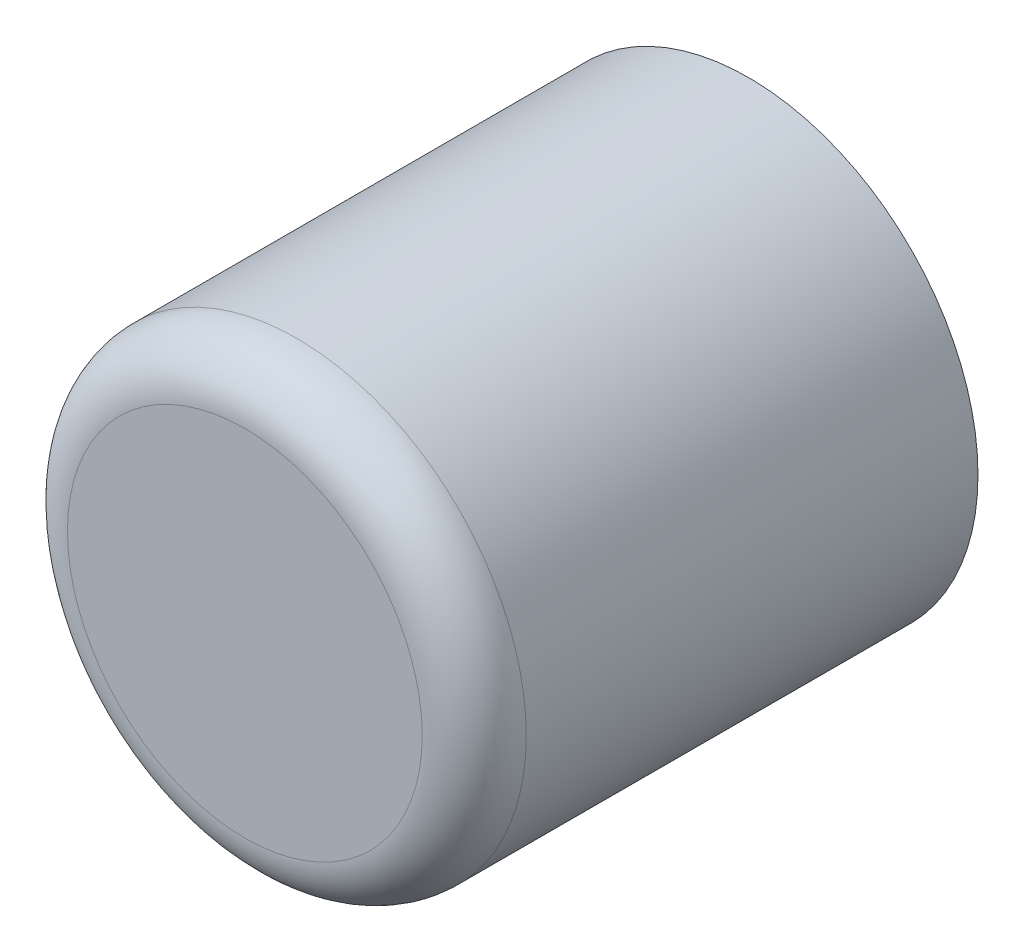
ISO-10303-21;
HEADER;
FILE_DESCRIPTION(('STEP AP214'),'2;1');
FILE_NAME('part.step','',(''),(''),'','','');
FILE_SCHEMA(('AUTOMOTIVE_DESIGN { 1 0 10303 214 1 1 1 1 }'));
ENDSEC;
DATA;
#1=APPLICATION_CONTEXT('core data for automotive mechanical design processes');
#2=APPLICATION_PROTOCOL_DEFINITION('international standard','automotive_design',2000,#1);
#3=PRODUCT_CONTEXT('',#1,'mechanical');
#4=PRODUCT('Part','Part','',(#3));
#5=PRODUCT_RELATED_PRODUCT_CATEGORY('part','',(#4));
#6=PRODUCT_DEFINITION_FORMATION('','',#4);
#7=PRODUCT_DEFINITION_CONTEXT('part definition',#1,'design');
#8=PRODUCT_DEFINITION('design','',#6,#7);
#9=PRODUCT_DEFINITION_SHAPE('','',#8);
#10=(LENGTH_UNIT() NAMED_UNIT(*) SI_UNIT(.MILLI.,.METRE.));
#11=(NAMED_UNIT(*) PLANE_ANGLE_UNIT() SI_UNIT($,.RADIAN.));
#12=(NAMED_UNIT(*) SI_UNIT($,.STERADIAN.) SOLID_ANGLE_UNIT());
#13=UNCERTAINTY_MEASURE_WITH_UNIT(LENGTH_MEASURE(1.E-05),#10,'distance_accuracy_value','');
#14=(GEOMETRIC_REPRESENTATION_CONTEXT(3) GLOBAL_UNCERTAINTY_ASSIGNED_CONTEXT((#13)) GLOBAL_UNIT_ASSIGNED_CONTEXT((#10,
#11,#12)) REPRESENTATION_CONTEXT('',''));
#15=CARTESIAN_POINT('',(0.,0.,0.));
#16=DIRECTION('',(0.,0.,1.));
#17=DIRECTION('',(1.,0.,0.));
#18=AXIS2_PLACEMENT_3D('',#15,#16,#17);
#19=CARTESIAN_POINT('',(-126.423352159799,-34.2539777719787,5.6300000000009));
#20=DIRECTION('',(0.,0.,1.));
#21=DIRECTION('',(1.,0.,0.));
#22=AXIS2_PLACEMENT_3D('',#19,#20,#21);
#23=PLANE('',#22);
#24=CARTESIAN_POINT('',(-127.923352159799,-34.2539777719787,5.63000000000092));
#25=DIRECTION('',(0.,0.,-1.));
#26=DIRECTION('',(-1.,0.,0.));
#27=AXIS2_PLACEMENT_3D('',#24,#25,#26);
#28=CIRCLE('',#27,3.);
#29=CARTESIAN_POINT('',(-127.923352159799,-37.2539777719787,5.63000000000092));
#30=VERTEX_POINT('',#29);
#31=CARTESIAN_POINT('',(-127.923352159799,-31.2539777719787,5.63000000000091));
#32=VERTEX_POINT('',#31);
#33=EDGE_CURVE('E22',#30,#32,#28,.T.);
#34=ORIENTED_EDGE('',*,*,#33,.F.);
#35=CARTESIAN_POINT('',(-124.923352159799,-34.2539777719787,5.6300000000009));
#36=CARTESIAN_POINT('',(-124.923351953979,-34.2867027019829,5.6300000000009));
#37=CARTESIAN_POINT('',(-124.923887612746,-34.3194276203168,5.6300000000009));
#38=CARTESIAN_POINT('',(-124.926029181994,-34.3848424205712,5.6300000000009));
#39=CARTESIAN_POINT('',(-124.927635092475,-34.4175323024917,5.6300000000009));
#40=CARTESIAN_POINT('',(-124.931915687691,-34.4828420168465,5.6300000000009));
#41=CARTESIAN_POINT('',(-124.934590372427,-34.5154618492808,5.6300000000009));
#42=CARTESIAN_POINT('',(-124.941005587138,-34.5805965366539,5.6300000000009));
#43=CARTESIAN_POINT('',(-124.944746117114,-34.6131113915928,5.6300000000009));
#44=CARTESIAN_POINT('',(-124.953289034241,-34.6780013056849,5.6300000000009));
#45=CARTESIAN_POINT('',(-124.958091421393,-34.710376364838,5.6300000000009));
#46=CARTESIAN_POINT('',(-124.968752905696,-34.7749520194869,5.6300000000009));
#47=CARTESIAN_POINT('',(-124.974612002847,-34.8071526149826,5.6300000000009));
#48=CARTESIAN_POINT('',(-124.987380634331,-34.8713448610715,5.6300000000009));
#49=CARTESIAN_POINT('',(-124.994290168663,-34.9033365116648,5.6300000000009));
#50=CARTESIAN_POINT('',(-125.009152275271,-34.9670766104989,5.6300000000009));
#51=CARTESIAN_POINT('',(-125.017104847546,-34.9988250587398,5.6300000000009));
#52=CARTESIAN_POINT('',(-125.034044514317,-35.0620447558327,5.6300000000009));
#53=CARTESIAN_POINT('',(-125.043031608812,-35.0935160046848,5.6300000000009));
#54=CARTESIAN_POINT('',(-125.062030696392,-35.1561476027994,5.6300000000009));
#55=CARTESIAN_POINT('',(-125.072042689477,-35.1873079520618,5.6300000000009));
#56=CARTESIAN_POINT('',(-125.09308085315,-35.2492843837145,5.6300000000009));
#57=CARTESIAN_POINT('',(-125.104107023738,-35.2801004661048,5.6300000000009));
#58=CARTESIAN_POINT('',(-125.127161735316,-35.34135536538,5.6300000000009));
#59=CARTESIAN_POINT('',(-125.139190276306,-35.371794182265,5.6300000000009));
#60=CARTESIAN_POINT('',(-125.164236848224,-35.4322619558829,5.6300000000009));
#61=CARTESIAN_POINT('',(-125.177254879153,-35.4622909126158,5.6300000000009));
#62=CARTESIAN_POINT('',(-125.204266490918,-35.5219068101679,5.6300000000009));
#63=CARTESIAN_POINT('',(-125.218260071754,-35.551493750987,5.6300000000009));
#64=CARTESIAN_POINT('',(-125.247207798648,-35.6101939342843,5.6300000000009));
#65=CARTESIAN_POINT('',(-125.262161944705,-35.6393071767625,5.6300000000009));
#66=CARTESIAN_POINT('',(-125.293014788803,-35.6970287881509,5.6300000000009));
#67=CARTESIAN_POINT('',(-125.308913486843,-35.7256371570611,5.6300000000009));
#68=CARTESIAN_POINT('',(-125.341638410048,-35.7823183868963,5.6300000000009));
#69=CARTESIAN_POINT('',(-125.358464635214,-35.8103912478214,5.6300000000009));
#70=CARTESIAN_POINT('',(-125.393026595225,-35.8659714000382,5.6300000000009));
#71=CARTESIAN_POINT('',(-125.410762330071,-35.8934786913299,5.6300000000009));
#72=CARTESIAN_POINT('',(-125.447124315712,-35.9478982507451,5.63000000000091));
#73=CARTESIAN_POINT('',(-125.465750566506,-35.9748105188685,5.63000000000093));
#74=CARTESIAN_POINT('',(-125.503873645543,-36.0280112062957,5.63000000000088));
#75=CARTESIAN_POINT('',(-125.523370473786,-36.0542996255994,5.6300000000008));
#76=CARTESIAN_POINT('',(-125.563213804065,-36.1062244924103,5.630000000001));
#77=CARTESIAN_POINT('',(-125.583560306102,-36.1318609399176,5.63000000000128));
#78=CARTESIAN_POINT('',(-125.62508129332,-36.1824543090217,5.63000000000053));
#79=CARTESIAN_POINT('',(-125.646255778502,-36.2074112306185,5.62999999999951));
#80=CARTESIAN_POINT('',(-125.689409696222,-36.2566192039393,5.63000000000229));
#81=CARTESIAN_POINT('',(-125.711389128761,-36.2808702556633,5.63000000000609));
#82=CARTESIAN_POINT('',(-125.75613075465,-36.3286391004313,5.62999999999571));
#83=CARTESIAN_POINT('',(-125.778892948002,-36.3521568934752,5.62999999998154));
#84=CARTESIAN_POINT('',(-125.826109025892,-36.3993777744703,5.63000000002105));
#85=CARTESIAN_POINT('',(-125.850594080175,-36.4230497012757,5.63000000007752));
#86=CARTESIAN_POINT('',(-125.900346723819,-36.4695566879093,5.62999999953919));
#87=CARTESIAN_POINT('',(-125.925614319341,-36.4923917411467,5.62999999894439));
#88=CARTESIAN_POINT('',(-125.976905260174,-36.5371977989582,5.62999999489594));
#89=CARTESIAN_POINT('',(-126.002928620797,-36.5591687860037,5.62999999144225));
#90=CARTESIAN_POINT('',(-126.055701174814,-36.6022228857514,5.62999997736708));
#91=CARTESIAN_POINT('',(-126.082450391898,-36.6233059694172,5.62999996674536));
#92=CARTESIAN_POINT('',(-126.136646027888,-36.6645585928952,5.62999993467281));
#93=CARTESIAN_POINT('',(-126.164092478166,-36.6847280914851,5.62999991322149));
#94=CARTESIAN_POINT('',(-126.219647150377,-36.7241377388085,5.62999984609745));
#95=CARTESIAN_POINT('',(-126.247755410253,-36.7433778340612,5.62999980042335));
#96=CARTESIAN_POINT('',(-126.304595494724,-36.7808653607649,5.62999970054135));
#97=CARTESIAN_POINT('',(-126.333326817421,-36.7991135525057,5.62999964634012));
#98=CARTESIAN_POINT('',(-126.391416372729,-36.83458478115,5.62999957414211));
#99=CARTESIAN_POINT('',(-126.420774619118,-36.8518077954938,5.62999955614612));
#100=CARTESIAN_POINT('',(-126.480075708778,-36.8852153796392,5.6299995571));
#101=CARTESIAN_POINT('',(-126.510018544079,-36.9013999635823,5.62999957604936));
#102=CARTESIAN_POINT('',(-126.570454247321,-36.9327024665219,5.62999964466184));
#103=CARTESIAN_POINT('',(-126.600947088105,-36.9478204379999,5.62999969432345));
#104=CARTESIAN_POINT('',(-126.662435539726,-36.9769930587181,5.62999980696543));
#105=CARTESIAN_POINT('',(-126.69343110768,-36.9910477980804,5.62999986994466));
#106=CARTESIAN_POINT('',(-126.755916412072,-37.0179944985407,5.62999996036133));
#107=CARTESIAN_POINT('',(-126.787406088521,-37.0308865995292,5.62999998780304));
#108=CARTESIAN_POINT('',(-126.860993103813,-37.0598363528705,5.63000001615267));
#109=CARTESIAN_POINT('',(-126.90322022208,-37.0755655186294,5.6300000055764));
#110=CARTESIAN_POINT('',(-126.992706812033,-37.1065605071642,5.6299999882976));
#111=CARTESIAN_POINT('',(-127.040040059572,-37.1216152246742,5.62999998210056));
#112=CARTESIAN_POINT('',(-127.121569389991,-37.1453539131281,5.62999995672505));
#113=CARTESIAN_POINT('',(-127.155597993742,-37.1546198705478,5.62999994182835));
#114=CARTESIAN_POINT('',(-127.220103732434,-37.1709519980343,5.6299999158846));
#115=CARTESIAN_POINT('',(-127.250547787793,-37.1781484241001,5.62999990459277));
#116=CARTESIAN_POINT('',(-127.307756506707,-37.190716270775,5.62999988959222));
#117=CARTESIAN_POINT('',(-127.334495855845,-37.1962033937431,5.62999988510076));
#118=CARTESIAN_POINT('',(-127.392160024052,-37.2072060564288,5.62999988190228));
#119=CARTESIAN_POINT('',(-127.423107925648,-37.2126010938175,5.62999988416972));
#120=CARTESIAN_POINT('',(-127.485158322068,-37.2224095837214,5.62999989215921));
#121=CARTESIAN_POINT('',(-127.516260815347,-37.2268230460232,5.62999989788122));
#122=CARTESIAN_POINT('',(-127.578589565838,-37.2346618100381,5.629999912843));
#123=CARTESIAN_POINT('',(-127.609815820718,-37.2380871302835,5.62999992208269));
#124=CARTESIAN_POINT('',(-127.672360281708,-37.2439467632407,5.62999994188619));
#125=CARTESIAN_POINT('',(-127.703678485262,-37.2463811032437,5.62999995244996));
#126=CARTESIAN_POINT('',(-127.766375168224,-37.2502561609506,5.62999997234505));
#127=CARTESIAN_POINT('',(-127.797753645402,-37.2516969147473,5.62999998167643));
#128=CARTESIAN_POINT('',(-127.860539073859,-37.253583653568,5.62999999543462));
#129=CARTESIAN_POINT('',(-127.891946023791,-37.2540296834677,5.62999999986165));
#130=CARTESIAN_POINT('',(-127.923352159799,-37.2539777719787,5.6300000000009));
#131=B_SPLINE_CURVE_WITH_KNOTS('',3,(#35,#36,#37,#38,#39,#40,#41,#42,#43,#44,#45,#46,#47,#48,
#49,#50,#51,#52,#53,#54,#55,#56,#57,#58,#59,#60,#61,#62,#63,#64,#65,#66,#67,#68,#69,#70,#71,#72,
#73,#74,#75,#76,#77,#78,#79,#80,#81,#82,#83,#84,#85,#86,#87,#88,#89,#90,#91,#92,#93,#94,#95,#96,
#97,#98,#99,#100,#101,#102,#103,#104,#105,#106,#107,#108,#109,#110,#111,#112,#113,#114,#115,
#116,#117,#118,#119,#120,#121,#122,#123,#124,#125,#126,#127,#128,#129,#130),.UNSPECIFIED.,.F.,
.F.,(4,2,2,2,2,2,2,2,2,2,2,2,2,2,2,2,2,2,2,2,2,2,2,2,2,2,2,2,2,2,2,2,2,2,2,2,2,2,2,2,2,2,2,2,2,
2,2,4),(0.,0.0981703897589186,0.196340779517836,0.294511169276759,0.392681559035682,
0.490851948794602,0.589022338553525,0.687192728312444,0.785363118071366,0.883533507830287,
0.98170389758921,1.07987428734813,1.17804467710705,1.27621506686596,1.37438545662489,
1.47255584638381,1.57072623614274,1.66889662590166,1.76706701566057,1.8652374054195,
1.96340779517841,2.06157818493733,2.15974857469625,2.25791896445517,2.3560893542141,
2.45824080914422,2.56039306840342,2.66254739887756,2.76470506743364,2.86686734091874,
2.96903548615872,3.07112418246518,3.17321512446506,3.27530467587824,3.37738920058261,
3.47946506263918,3.58152862631764,3.71667580860674,3.86561529048176,3.97139844419887,
4.06523105882204,4.14711080733812,4.24133836860666,4.33556499035077,4.42978984477901,
4.5240121041073,4.6182309405592,4.71244552636646),.UNSPECIFIED.);
#132=CARTESIAN_POINT('',(-124.923352159799,-34.2539780390437,5.6300000000009));
#133=VERTEX_POINT('',#132);
#134=EDGE_CURVE('E36',#133,#30,#131,.T.);
#135=ORIENTED_EDGE('',*,*,#134,.F.);
#136=CARTESIAN_POINT('',(-127.923352159799,-31.2539777719787,5.6300000000009));
#137=CARTESIAN_POINT('',(-127.890627229795,-31.2539775661587,5.6300000000009));
#138=CARTESIAN_POINT('',(-127.857902311461,-31.2545132249256,5.6300000000009));
#139=CARTESIAN_POINT('',(-127.792487511206,-31.2566547941736,5.6300000000009));
#140=CARTESIAN_POINT('',(-127.759797629286,-31.2582607046547,5.6300000000009));
#141=CARTESIAN_POINT('',(-127.694487914931,-31.2625412998711,5.6300000000009));
#142=CARTESIAN_POINT('',(-127.661868082497,-31.2652159846065,5.6300000000009));
#143=CARTESIAN_POINT('',(-127.596733395124,-31.2716311993177,5.6300000000009));
#144=CARTESIAN_POINT('',(-127.564218540185,-31.2753717292936,5.6300000000009));
#145=CARTESIAN_POINT('',(-127.499328626093,-31.283914646421,5.6300000000009));
#146=CARTESIAN_POINT('',(-127.46695356694,-31.2887170335725,5.6300000000009));
#147=CARTESIAN_POINT('',(-127.402377912291,-31.2993785178756,5.6300000000009));
#148=CARTESIAN_POINT('',(-127.370177316795,-31.3052376150272,5.6300000000009));
#149=CARTESIAN_POINT('',(-127.305985070706,-31.3180062465108,5.6300000000009));
#150=CARTESIAN_POINT('',(-127.273993420113,-31.3249157808429,5.6300000000009));
#151=CARTESIAN_POINT('',(-127.210253321279,-31.3397778874505,5.6300000000009));
#152=CARTESIAN_POINT('',(-127.178504873038,-31.3477304597261,5.6300000000009));
#153=CARTESIAN_POINT('',(-127.115285175945,-31.3646701264969,5.6300000000009));
#154=CARTESIAN_POINT('',(-127.083813927093,-31.3736572209921,5.6300000000009));
#155=CARTESIAN_POINT('',(-127.021182328978,-31.3926563085721,5.6300000000009));
#156=CARTESIAN_POINT('',(-126.990021979716,-31.402668301657,5.6300000000009));
#157=CARTESIAN_POINT('',(-126.928045548063,-31.4237064653298,5.6300000000009));
#158=CARTESIAN_POINT('',(-126.897229465673,-31.4347326359178,5.6300000000009));
#159=CARTESIAN_POINT('',(-126.835974566398,-31.4577873474957,5.6300000000009));
#160=CARTESIAN_POINT('',(-126.805535749513,-31.4698158884856,5.6300000000009));
#161=CARTESIAN_POINT('',(-126.745067975895,-31.4948624604041,5.6300000000009));
#162=CARTESIAN_POINT('',(-126.715039019162,-31.5078804913327,5.6300000000009));
#163=CARTESIAN_POINT('',(-126.65542312161,-31.5348921030976,5.6300000000009));
#164=CARTESIAN_POINT('',(-126.625836180791,-31.5488856839338,5.6300000000009));
#165=CARTESIAN_POINT('',(-126.567135997493,-31.5778334108274,5.6300000000009));
#166=CARTESIAN_POINT('',(-126.538022755015,-31.5927875568848,5.6300000000009));
#167=CARTESIAN_POINT('',(-126.480301143627,-31.6236404009824,5.6300000000009));
#168=CARTESIAN_POINT('',(-126.451692774717,-31.6395390990227,5.6300000000009));
#169=CARTESIAN_POINT('',(-126.395011544881,-31.6722640222281,5.6300000000009));
#170=CARTESIAN_POINT('',(-126.366938683956,-31.6890902473933,5.6300000000009));
#171=CARTESIAN_POINT('',(-126.31135853174,-31.7236522074047,5.6300000000009));
#172=CARTESIAN_POINT('',(-126.283851240448,-31.7413879422509,5.6300000000009));
#173=CARTESIAN_POINT('',(-126.229431681033,-31.7777499278912,5.63000000000091));
#174=CARTESIAN_POINT('',(-126.202519412909,-31.7963761786853,5.63000000000093));
#175=CARTESIAN_POINT('',(-126.149318725482,-31.8344992577224,5.63000000000088));
#176=CARTESIAN_POINT('',(-126.123030306178,-31.8539960859653,5.6300000000008));
#177=CARTESIAN_POINT('',(-126.071105439367,-31.8938394162447,5.630000000001));
#178=CARTESIAN_POINT('',(-126.04546899186,-31.9141859182813,5.63000000000128));
#179=CARTESIAN_POINT('',(-125.994875622756,-31.9557069054997,5.63000000000053));
#180=CARTESIAN_POINT('',(-125.969918701159,-31.9768813906816,5.62999999999951));
#181=CARTESIAN_POINT('',(-125.920710727838,-32.0200353084019,5.63000000000229));
#182=CARTESIAN_POINT('',(-125.896459676114,-32.0420147409403,5.63000000000609));
#183=CARTESIAN_POINT('',(-125.848690831346,-32.0867563668301,5.62999999999571));
#184=CARTESIAN_POINT('',(-125.825173038302,-32.1095185601814,5.62999999998154));
#185=CARTESIAN_POINT('',(-125.777952157308,-32.1567346380713,5.63000000002105));
#186=CARTESIAN_POINT('',(-125.754280230503,-32.1812196923537,5.63000000007752));
#187=CARTESIAN_POINT('',(-125.70777324387,-32.2309723359976,5.62999999953919));
#188=CARTESIAN_POINT('',(-125.684938190633,-32.2562399315191,5.62999999894439));
#189=CARTESIAN_POINT('',(-125.640132132822,-32.3075308723508,5.62999999489594));
#190=CARTESIAN_POINT('',(-125.618161145777,-32.333554232974,5.62999999144225));
#191=CARTESIAN_POINT('',(-125.57510704603,-32.3863267869904,5.62999997736708));
#192=CARTESIAN_POINT('',(-125.554023962365,-32.4130760040738,5.62999996674536));
#193=CARTESIAN_POINT('',(-125.512771338887,-32.4672716400626,5.62999993467281));
#194=CARTESIAN_POINT('',(-125.492601840298,-32.4947180903411,5.62999991322149));
#195=CARTESIAN_POINT('',(-125.453192192975,-32.5502727625506,5.62999984609746));
#196=CARTESIAN_POINT('',(-125.433952097723,-32.5783810224262,5.62999980042335));
#197=CARTESIAN_POINT('',(-125.396464571019,-32.6352211068979,5.62999970054135));
#198=CARTESIAN_POINT('',(-125.378216379278,-32.6639524295946,5.62999964634012));
#199=CARTESIAN_POINT('',(-125.342745150633,-32.7220419849041,5.62999957414211));
#200=CARTESIAN_POINT('',(-125.325522136289,-32.7514002312935,5.62999955614613));
#201=CARTESIAN_POINT('',(-125.292114552143,-32.8107013209535,5.6299995571));
#202=CARTESIAN_POINT('',(-125.2759299682,-32.8406441562558,5.62999957604936));
#203=CARTESIAN_POINT('',(-125.244627465259,-32.9010798594976,5.62999964466184));
#204=CARTESIAN_POINT('',(-125.229509493781,-32.9315727002818,5.62999969432345));
#205=CARTESIAN_POINT('',(-125.200336873063,-32.9930611519043,5.62999980696543));
#206=CARTESIAN_POINT('',(-125.186282133702,-33.0240567198593,5.62999986994467));
#207=CARTESIAN_POINT('',(-125.159335433236,-33.0865420242497,5.62999996036133));
#208=CARTESIAN_POINT('',(-125.14644333224,-33.1180317006964,5.62999998780304));
#209=CARTESIAN_POINT('',(-125.117493577769,-33.1916187189207,5.63000001615267));
#210=CARTESIAN_POINT('',(-125.101764411006,-33.2338458401685,5.63000000557641));
#211=CARTESIAN_POINT('',(-125.070769422759,-33.3233324302199,5.62999998829761));
#212=CARTESIAN_POINT('',(-125.055714706246,-33.370665674771,5.62999998210056));
#213=CARTESIAN_POINT('',(-125.031976020928,-33.452194994282,5.62999995672505));
#214=CARTESIAN_POINT('',(-125.022710065516,-33.4862235900726,5.62999994182835));
#215=CARTESIAN_POINT('',(-125.006377939505,-33.5507293206757,5.6299999158846));
#216=CARTESIAN_POINT('',(-124.999181513191,-33.5811733759761,5.62999990459277));
#217=CARTESIAN_POINT('',(-124.986613664291,-33.6383821028002,5.62999988959222));
#218=CARTESIAN_POINT('',(-124.981126539568,-33.6651214599564,5.62999988510076));
#219=CARTESIAN_POINT('',(-124.970123875353,-33.7227856362241,5.62999988190228));
#220=CARTESIAN_POINT('',(-124.964728837965,-33.7537335378208,5.62999988416972));
#221=CARTESIAN_POINT('',(-124.954920348064,-33.8157839342415,5.62999989215921));
#222=CARTESIAN_POINT('',(-124.950506885764,-33.8468864275209,5.62999989788123));
#223=CARTESIAN_POINT('',(-124.942668121751,-33.9092151780132,5.629999912843));
#224=CARTESIAN_POINT('',(-124.939242801506,-33.9404414328939,5.6299999220827));
#225=CARTESIAN_POINT('',(-124.933383168549,-34.0029858938849,5.6299999418862));
#226=CARTESIAN_POINT('',(-124.930948828545,-34.0343040974392,5.62999995244996));
#227=CARTESIAN_POINT('',(-124.927073770837,-34.0970007804021,5.62999997234506));
#228=CARTESIAN_POINT('',(-124.925633017039,-34.1283792575796,5.62999998167643));
#229=CARTESIAN_POINT('',(-124.923746278215,-34.1911646860379,5.62999999543462));
#230=CARTESIAN_POINT('',(-124.923300248313,-34.2225716359702,5.62999999986165));
#231=CARTESIAN_POINT('',(-124.923352159799,-34.2539777719787,5.6300000000009));
#232=B_SPLINE_CURVE_WITH_KNOTS('',3,(#136,#137,#138,#139,#140,#141,#142,#143,#144,#145,#146,
#147,#148,#149,#150,#151,#152,#153,#154,#155,#156,#157,#158,#159,#160,#161,#162,#163,#164,#165,
#166,#167,#168,#169,#170,#171,#172,#173,#174,#175,#176,#177,#178,#179,#180,#181,#182,#183,#184,
#185,#186,#187,#188,#189,#190,#191,#192,#193,#194,#195,#196,#197,#198,#199,#200,#201,#202,#203,
#204,#205,#206,#207,#208,#209,#210,#211,#212,#213,#214,#215,#216,#217,#218,#219,#220,#221,#222,
#223,#224,#225,#226,#227,#228,#229,#230,#231),.UNSPECIFIED.,.F.,.F.,(4,2,2,2,2,2,2,2,2,2,2,2,2,
2,2,2,2,2,2,2,2,2,2,2,2,2,2,2,2,2,2,2,2,2,2,2,2,2,2,2,2,2,2,2,2,2,2,4),(0.,0.0981703897589115,
0.19634077951785,0.294511169276758,0.392681559035668,0.490851948794602,0.589022338553519,
0.687192728312448,0.785363118071355,0.883533507830274,0.981703897589212,1.07987428734812,
1.17804467710705,1.27621506686596,1.37438545662488,1.4725558463838,1.57072623614273,
1.66889662590165,1.76706701566057,1.86523740541949,1.96340779517841,2.06157818493734,
2.15974857469625,2.25791896445517,2.35608935421409,2.45824080914268,2.56039306840033,
2.66254739887293,2.76470506742748,2.86686734091103,2.96903548614943,3.0711241824573,
3.17321512445863,3.27530467587324,3.37738920057908,3.47946506263711,3.58152862631709,
3.71667581802958,3.8656152904729,3.97139841958161,4.06523103420415,4.14711080732997,
4.24133836859989,4.33556499034524,4.42978984477466,4.52401210410411,4.61823094055729,
4.712445526366),.UNSPECIFIED.);
#233=EDGE_CURVE('E40',#32,#133,#232,.T.);
#234=ORIENTED_EDGE('',*,*,#233,.F.);
#235=EDGE_LOOP('',(#34,#135,#234));
#236=FACE_BOUND('',#235,.T.);
#237=ADVANCED_FACE('F17',(#236),#23,.T.);
#238=CARTESIAN_POINT('',(-127.923352159799,-34.2539777719787,-2.89151100498955));
#239=DIRECTION('',(0.,0.,1.));
#240=DIRECTION('',(0.,-1.,0.));
#241=AXIS2_PLACEMENT_3D('',#238,#239,#240);
#242=PLANE('',#241);
#243=CARTESIAN_POINT('',(-127.923352159799,-34.2539777719787,-2.89151100498863));
#244=DIRECTION('',(0.,0.,1.));
#245=DIRECTION('',(1.,0.,0.));
#246=AXIS2_PLACEMENT_3D('',#243,#244,#245);
#247=CIRCLE('',#246,3.87999999999999);
#248=CARTESIAN_POINT('',(-124.043352159799,-34.2539777719787,-2.89151100498863));
#249=VERTEX_POINT('',#248);
#250=EDGE_CURVE('E28',#249,#249,#247,.T.);
#251=ORIENTED_EDGE('',*,*,#250,.F.);
#252=EDGE_LOOP('',(#251));
#253=FACE_BOUND('',#252,.T.);
#254=ADVANCED_FACE('F61',(#253),#242,.F.);
#255=CARTESIAN_POINT('',(-127.923352159799,-34.2539777719787,4.7500000000009));
#256=DIRECTION('',(0.,0.,-1.));
#257=DIRECTION('',(-1.,0.,0.));
#258=AXIS2_PLACEMENT_3D('',#255,#256,#257);
#259=TOROIDAL_SURFACE('',#258,3.,0.880000000000004);
#260=CARTESIAN_POINT('',(-127.923352159799,-34.2539777719787,4.75000000000091));
#261=DIRECTION('',(0.,0.,1.));
#262=DIRECTION('',(1.,0.,0.));
#263=AXIS2_PLACEMENT_3D('',#260,#261,#262);
#264=CIRCLE('',#263,3.87999999999999);
#265=CARTESIAN_POINT('',(-124.043352159799,-34.2539777719787,4.75000000000091));
#266=VERTEX_POINT('',#265);
#267=EDGE_CURVE('E11',#266,#266,#264,.F.);
#268=ORIENTED_EDGE('',*,*,#267,.F.);
#269=EDGE_LOOP('',(#268));
#270=FACE_BOUND('',#269,.T.);
#271=ORIENTED_EDGE('',*,*,#233,.T.);
#272=ORIENTED_EDGE('',*,*,#134,.T.);
#273=ORIENTED_EDGE('',*,*,#33,.T.);
#274=EDGE_LOOP('',(#271,#272,#273));
#275=FACE_BOUND('',#274,.T.);
#276=ADVANCED_FACE('F19',(#270,#275),#259,.T.);
#277=CARTESIAN_POINT('',(-127.923352159799,-34.2539777719787,0.898559059801258));
#278=DIRECTION('',(0.,0.,1.));
#279=DIRECTION('',(1.,0.,0.));
#280=AXIS2_PLACEMENT_3D('',#277,#278,#279);
#281=CYLINDRICAL_SURFACE('',#280,3.87999999999999);
#282=ORIENTED_EDGE('',*,*,#267,.T.);
#283=EDGE_LOOP('',(#282));
#284=FACE_BOUND('',#283,.T.);
#285=ORIENTED_EDGE('',*,*,#250,.T.);
#286=EDGE_LOOP('',(#285));
#287=FACE_BOUND('',#286,.T.);
#288=ADVANCED_FACE('F59',(#284,#287),#281,.T.);
#289=CLOSED_SHELL('',(#237,#254,#276,#288));
#290=MANIFOLD_SOLID_BREP('B1',#289);
#291=ADVANCED_BREP_SHAPE_REPRESENTATION('',(#18,#290),#14);
#292=SHAPE_DEFINITION_REPRESENTATION(#9,#291);
ENDSEC;
END-ISO-10303-21;
